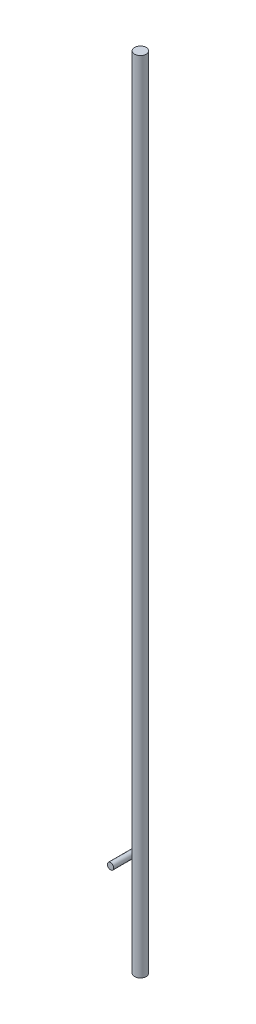
ISO-10303-21;
HEADER;
FILE_DESCRIPTION(('STEP AP214'),'2;1');
FILE_NAME('part.step','',(''),(''),'','','');
FILE_SCHEMA(('AUTOMOTIVE_DESIGN { 1 0 10303 214 1 1 1 1 }'));
ENDSEC;
DATA;
#1=APPLICATION_CONTEXT('core data for automotive mechanical design processes');
#2=APPLICATION_PROTOCOL_DEFINITION('international standard','automotive_design',2000,#1);
#3=PRODUCT_CONTEXT('',#1,'mechanical');
#4=PRODUCT('Part','Part','',(#3));
#5=PRODUCT_RELATED_PRODUCT_CATEGORY('part','',(#4));
#6=PRODUCT_DEFINITION_FORMATION('','',#4);
#7=PRODUCT_DEFINITION_CONTEXT('part definition',#1,'design');
#8=PRODUCT_DEFINITION('design','',#6,#7);
#9=PRODUCT_DEFINITION_SHAPE('','',#8);
#10=(LENGTH_UNIT() NAMED_UNIT(*) SI_UNIT(.MILLI.,.METRE.));
#11=(NAMED_UNIT(*) PLANE_ANGLE_UNIT() SI_UNIT($,.RADIAN.));
#12=(NAMED_UNIT(*) SI_UNIT($,.STERADIAN.) SOLID_ANGLE_UNIT());
#13=UNCERTAINTY_MEASURE_WITH_UNIT(LENGTH_MEASURE(1.E-05),#10,'distance_accuracy_value','');
#14=(GEOMETRIC_REPRESENTATION_CONTEXT(3) GLOBAL_UNCERTAINTY_ASSIGNED_CONTEXT((#13)) GLOBAL_UNIT_ASSIGNED_CONTEXT((#10,
#11,#12)) REPRESENTATION_CONTEXT('',''));
#15=CARTESIAN_POINT('',(0.,0.,0.));
#16=DIRECTION('',(0.,0.,1.));
#17=DIRECTION('',(1.,0.,0.));
#18=AXIS2_PLACEMENT_3D('',#15,#16,#17);
#19=CARTESIAN_POINT('',(0.,-9.,0.));
#20=DIRECTION('',(0.,1.,0.));
#21=DIRECTION('',(0.,0.,1.));
#22=AXIS2_PLACEMENT_3D('',#19,#20,#21);
#23=CYLINDRICAL_SURFACE('',#22,0.55);
#24=CARTESIAN_POINT('',(-0.5,0.3,-0.229128784747792));
#25=CARTESIAN_POINT('',(-0.500000615052009,0.292780073128567,-0.229127960567522));
#26=CARTESIAN_POINT('',(-0.500263617192523,0.285548124588731,-0.228556254733447));
#27=CARTESIAN_POINT('',(-0.501291039483298,0.271287392833323,-0.226293468677813));
#28=CARTESIAN_POINT('',(-0.502056758931474,0.264259185478576,-0.224599487776873));
#29=CARTESIAN_POINT('',(-0.504009916052999,0.250633785424472,-0.220181184157631));
#30=CARTESIAN_POINT('',(-0.505195462860505,0.244034814697188,-0.217461477703977));
#31=CARTESIAN_POINT('',(-0.507883351945307,0.231371757249211,-0.21110743743554));
#32=CARTESIAN_POINT('',(-0.509385588579757,0.225307493113013,-0.207473408546608));
#33=CARTESIAN_POINT('',(-0.512751891877452,0.213214115031851,-0.199017841941242));
#34=CARTESIAN_POINT('',(-0.514637095993687,0.207248692518458,-0.194114066562963));
#35=CARTESIAN_POINT('',(-0.51850683464525,0.196093745383431,-0.183528117036071));
#36=CARTESIAN_POINT('',(-0.52049144478887,0.190904823707308,-0.177845344496362));
#37=CARTESIAN_POINT('',(-0.525470949311629,0.178769368260982,-0.162702997579471));
#38=CARTESIAN_POINT('',(-0.528448729990879,0.172332019595852,-0.152827946500478));
#39=CARTESIAN_POINT('',(-0.534014906246082,0.161107184773262,-0.132077345613177));
#40=CARTESIAN_POINT('',(-0.536602380055928,0.156323570797794,-0.121199522200019));
#41=CARTESIAN_POINT('',(-0.541845828857075,0.147052443031229,-0.0955037784663739));
#42=CARTESIAN_POINT('',(-0.544299762020906,0.143062313613454,-0.0804652274536857));
#43=CARTESIAN_POINT('',(-0.547955804363976,0.13725723485879,-0.0498335801124002));
#44=CARTESIAN_POINT('',(-0.549156980690798,0.135443906302627,-0.0342400794683822));
#45=CARTESIAN_POINT('',(-0.550222437242496,0.133831082835456,-0.00270494681483289));
#46=CARTESIAN_POINT('',(-0.55006939295928,0.134057685345915,0.0132385858586871));
#47=CARTESIAN_POINT('',(-0.548393899350324,0.136608241015638,0.0448853839492023));
#48=CARTESIAN_POINT('',(-0.546872042166469,0.138931287264873,0.0605887502739115));
#49=CARTESIAN_POINT('',(-0.542914809312699,0.145342550478439,0.0889773282619028));
#50=CARTESIAN_POINT('',(-0.540652955672643,0.149109676618298,0.101759117020398));
#51=CARTESIAN_POINT('',(-0.535410485374579,0.158502769329982,0.126467685999101));
#52=CARTESIAN_POINT('',(-0.532430908808856,0.164126050371813,0.138395671359755));
#53=CARTESIAN_POINT('',(-0.526869600966437,0.175782216830233,0.158068054402563));
#54=CARTESIAN_POINT('',(-0.524376673506454,0.181355234290787,0.166109496634244));
#55=CARTESIAN_POINT('',(-0.519367360557462,0.193746342392372,0.181163295588935));
#56=CARTESIAN_POINT('',(-0.516851012765064,0.200562680282243,0.188177076252886));
#57=CARTESIAN_POINT('',(-0.512510052946658,0.214036672296523,0.199659616665285));
#58=CARTESIAN_POINT('',(-0.510644274194136,0.220483793210186,0.204358966043845));
#59=CARTESIAN_POINT('',(-0.507237458937944,0.23412596130427,0.212674338803907));
#60=CARTESIAN_POINT('',(-0.5056962995694,0.241320723965192,0.216290772276502));
#61=CARTESIAN_POINT('',(-0.503093031542915,0.256356520917574,0.222279732754516));
#62=CARTESIAN_POINT('',(-0.5020342663879,0.264201633280307,0.224643595969569));
#63=CARTESIAN_POINT('',(-0.500543162928967,0.280244138025832,0.227947279204893));
#64=CARTESIAN_POINT('',(-0.500110441357369,0.288441311706452,0.228887970515775));
#65=CARTESIAN_POINT('',(-0.499937570418446,0.30391001414519,0.229264842627182));
#66=CARTESIAN_POINT('',(-0.500122081698287,0.311177241591148,0.228864677807365));
#67=CARTESIAN_POINT('',(-0.50100158347444,0.325526104240811,0.226932872983028));
#68=CARTESIAN_POINT('',(-0.501696490345602,0.332607769650871,0.225401418333095));
#69=CARTESIAN_POINT('',(-0.503509718512839,0.346261489224009,0.221320511711263));
#70=CARTESIAN_POINT('',(-0.50461975601312,0.352840663130478,0.218790925977986));
#71=CARTESIAN_POINT('',(-0.507166511336889,0.365500389622152,0.212820646263089));
#72=CARTESIAN_POINT('',(-0.508603298642891,0.371580835779435,0.20937975846976));
#73=CARTESIAN_POINT('',(-0.511849854191815,0.383744076090674,0.201321491849194));
#74=CARTESIAN_POINT('',(-0.513682648018052,0.389764914692259,0.196620322812821));
#75=CARTESIAN_POINT('',(-0.51746834067469,0.401051233501053,0.186430116018835));
#76=CARTESIAN_POINT('',(-0.519421318698439,0.406316207862836,0.180940555517194));
#77=CARTESIAN_POINT('',(-0.524322386527122,0.418597958166595,0.166346761067998));
#78=CARTESIAN_POINT('',(-0.527267555077224,0.425129819971954,0.15683178273265));
#79=CARTESIAN_POINT('',(-0.532821163342139,0.436587218746643,0.136786868879401));
#80=CARTESIAN_POINT('',(-0.535428806126087,0.441508994502317,0.12625463024028));
#81=CARTESIAN_POINT('',(-0.540794391340185,0.451168575934791,0.101241410136865));
#82=CARTESIAN_POINT('',(-0.54336134743728,0.455405152032708,0.0865260403898665));
#83=CARTESIAN_POINT('',(-0.547301347493032,0.461731270371875,0.0564945438084415));
#84=CARTESIAN_POINT('',(-0.548673488461788,0.463819188966462,0.0411779717311298));
#85=CARTESIAN_POINT('',(-0.550129516613197,0.466031644378769,0.0101250847259749));
#86=CARTESIAN_POINT('',(-0.550194739741033,0.466127736649009,-0.00561410095782929));
#87=CARTESIAN_POINT('',(-0.548982503555806,0.464291039433624,-0.0369228006015882));
#88=CARTESIAN_POINT('',(-0.547705406343319,0.462358797106039,-0.0524923591752315));
#89=CARTESIAN_POINT('',(-0.544133274198306,0.456658898127433,-0.0812665168632025));
#90=CARTESIAN_POINT('',(-0.541974146577982,0.453131265164646,-0.0945353347038504));
#91=CARTESIAN_POINT('',(-0.536853185146215,0.444154875600608,-0.120247325369138));
#92=CARTESIAN_POINT('',(-0.533892437454966,0.438708715439619,-0.13269158719789));
#93=CARTESIAN_POINT('',(-0.528303302302386,0.427318084754432,-0.153227275393883));
#94=CARTESIAN_POINT('',(-0.525784104394764,0.421858762646939,-0.161617073907401));
#95=CARTESIAN_POINT('',(-0.520678277072094,0.409649564271953,-0.17737626727889));
#96=CARTESIAN_POINT('',(-0.518091761580121,0.402901759649638,-0.184747267822253));
#97=CARTESIAN_POINT('',(-0.513603422063562,0.389535133263326,-0.196837357100697));
#98=CARTESIAN_POINT('',(-0.51166590740201,0.383143630850994,-0.201793634118933));
#99=CARTESIAN_POINT('',(-0.508092840356811,0.369565534326612,-0.210628596653856));
#100=CARTESIAN_POINT('',(-0.506457374127147,0.362378714296158,-0.214506974877697));
#101=CARTESIAN_POINT('',(-0.503651732228966,0.347296885193054,-0.221015236340717));
#102=CARTESIAN_POINT('',(-0.502485588915381,0.3393964242852,-0.223634335861985));
#103=CARTESIAN_POINT('',(-0.500788890127222,0.32320274668569,-0.227409252110794));
#104=CARTESIAN_POINT('',(-0.500256116708228,0.314911006900157,-0.228570175913194));
#105=CARTESIAN_POINT('',(-0.500023966911561,0.304396993161306,-0.2290763262732));
#106=CARTESIAN_POINT('',(-0.499999812666703,0.302199054204091,-0.229129035777632));
#107=CARTESIAN_POINT('',(-0.5,0.3,-0.229128784747792));
#108=B_SPLINE_CURVE_WITH_KNOTS('',3,(#24,#25,#26,#27,#28,#29,#30,#31,#32,#33,#34,#35,#36,#37,
#38,#39,#40,#41,#42,#43,#44,#45,#46,#47,#48,#49,#50,#51,#52,#53,#54,#55,#56,#57,#58,#59,#60,#61,
#62,#63,#64,#65,#66,#67,#68,#69,#70,#71,#72,#73,#74,#75,#76,#77,#78,#79,#80,#81,#82,#83,#84,#85,
#86,#87,#88,#89,#90,#91,#92,#93,#94,#95,#96,#97,#98,#99,#100,#101,#102,#103,#104,#105,#106,
#107),.UNSPECIFIED.,.T.,.F.,(4,2,2,2,2,2,2,2,2,2,2,2,2,2,2,2,2,2,2,2,2,2,2,2,2,2,2,2,2,2,2,2,2,
2,2,2,2,2,2,2,2,4),(0.,0.0216540065189272,0.0433642003886249,0.0649778316909561,
0.0865842643957392,0.110343253934834,0.134120597429102,0.170392215922303,0.206748197319461,
0.253755994950514,0.300798771513836,0.348444226605623,0.396069080410436,0.43647205105778,
0.476816820071673,0.507000345265475,0.537141644036394,0.561623289403841,0.586095652020478,
0.610735145859877,0.63535954885933,0.657093235549981,0.678823362104999,0.700141193064925,
0.721463561453055,0.7449423755788,0.768436829859763,0.803971122005495,0.839587840311551,
0.885924475273332,0.932296099153078,0.979329490130709,1.02635019676801,1.06789354564355,
1.10938088643471,1.14023912201728,1.17104815469475,1.19590030117396,1.22075952537835,
1.24582799664503,1.2708084217145,1.27740382564571),.UNSPECIFIED.);
#109=CARTESIAN_POINT('',(-0.5,0.3,-0.229128784747792));
#110=VERTEX_POINT('',#109);
#111=EDGE_CURVE('E10',#110,#110,#108,.T.);
#112=ORIENTED_EDGE('',*,*,#111,.F.);
#113=EDGE_LOOP('',(#112));
#114=FACE_BOUND('',#113,.T.);
#115=CARTESIAN_POINT('',(0.,-9.,0.));
#116=DIRECTION('',(0.,1.,0.));
#117=DIRECTION('',(0.,0.,1.));
#118=AXIS2_PLACEMENT_3D('',#115,#116,#117);
#119=CIRCLE('',#118,0.55);
#120=CARTESIAN_POINT('',(0.,-9.,0.55));
#121=VERTEX_POINT('',#120);
#122=EDGE_CURVE('E40',#121,#121,#119,.T.);
#123=ORIENTED_EDGE('',*,*,#122,.T.);
#124=EDGE_LOOP('',(#123));
#125=FACE_BOUND('',#124,.T.);
#126=CARTESIAN_POINT('',(0.,66.,0.));
#127=DIRECTION('',(0.,1.,0.));
#128=DIRECTION('',(0.,0.,1.));
#129=AXIS2_PLACEMENT_3D('',#126,#127,#128);
#130=CIRCLE('',#129,0.55);
#131=CARTESIAN_POINT('',(0.,66.,0.55));
#132=VERTEX_POINT('',#131);
#133=EDGE_CURVE('E44',#132,#132,#130,.T.);
#134=ORIENTED_EDGE('',*,*,#133,.F.);
#135=EDGE_LOOP('',(#134));
#136=FACE_BOUND('',#135,.T.);
#137=ADVANCED_FACE('F30',(#114,#125,#136),#23,.T.);
#138=CARTESIAN_POINT('',(0.,-9.,0.));
#139=DIRECTION('',(0.,1.,0.));
#140=DIRECTION('',(0.,0.,1.));
#141=AXIS2_PLACEMENT_3D('',#138,#139,#140);
#142=PLANE('',#141);
#143=ORIENTED_EDGE('',*,*,#122,.F.);
#144=EDGE_LOOP('',(#143));
#145=FACE_BOUND('',#144,.T.);
#146=ADVANCED_FACE('F69',(#145),#142,.F.);
#147=CARTESIAN_POINT('',(0.,66.,0.));
#148=DIRECTION('',(0.,1.,0.));
#149=DIRECTION('',(0.,0.,1.));
#150=AXIS2_PLACEMENT_3D('',#147,#148,#149);
#151=PLANE('',#150);
#152=ORIENTED_EDGE('',*,*,#133,.T.);
#153=EDGE_LOOP('',(#152));
#154=FACE_BOUND('',#153,.T.);
#155=ADVANCED_FACE('F62',(#154),#151,.T.);
#156=CARTESIAN_POINT('',(-0.8,0.3,-0.5));
#157=DIRECTION('',(0.,0.,1.));
#158=DIRECTION('',(1.,0.,0.));
#159=AXIS2_PLACEMENT_3D('',#156,#157,#158);
#160=CYLINDRICAL_SURFACE('',#159,0.3);
#161=ORIENTED_EDGE('',*,*,#111,.T.);
#162=EDGE_LOOP('',(#161));
#163=FACE_BOUND('',#162,.T.);
#164=CARTESIAN_POINT('',(-0.8,0.3,-0.5));
#165=DIRECTION('',(0.,0.,1.));
#166=DIRECTION('',(1.,0.,0.));
#167=AXIS2_PLACEMENT_3D('',#164,#165,#166);
#168=CIRCLE('',#167,0.3);
#169=CARTESIAN_POINT('',(-0.5,0.3,-0.5));
#170=VERTEX_POINT('',#169);
#171=EDGE_CURVE('E48',#170,#170,#168,.T.);
#172=ORIENTED_EDGE('',*,*,#171,.T.);
#173=EDGE_LOOP('',(#172));
#174=FACE_BOUND('',#173,.T.);
#175=CARTESIAN_POINT('',(-0.8,0.3,2.));
#176=DIRECTION('',(0.,0.,1.));
#177=DIRECTION('',(1.,0.,0.));
#178=AXIS2_PLACEMENT_3D('',#175,#176,#177);
#179=CIRCLE('',#178,0.3);
#180=CARTESIAN_POINT('',(-0.5,0.3,2.));
#181=VERTEX_POINT('',#180);
#182=EDGE_CURVE('E53',#181,#181,#179,.T.);
#183=ORIENTED_EDGE('',*,*,#182,.F.);
#184=EDGE_LOOP('',(#183));
#185=FACE_BOUND('',#184,.T.);
#186=ADVANCED_FACE('F59',(#163,#174,#185),#160,.T.);
#187=CARTESIAN_POINT('',(-0.8,0.3,-0.5));
#188=DIRECTION('',(0.,0.,1.));
#189=DIRECTION('',(1.,0.,0.));
#190=AXIS2_PLACEMENT_3D('',#187,#188,#189);
#191=PLANE('',#190);
#192=ORIENTED_EDGE('',*,*,#171,.F.);
#193=EDGE_LOOP('',(#192));
#194=FACE_BOUND('',#193,.T.);
#195=ADVANCED_FACE('F61',(#194),#191,.F.);
#196=CARTESIAN_POINT('',(-0.8,0.3,2.));
#197=DIRECTION('',(0.,0.,1.));
#198=DIRECTION('',(1.,0.,0.));
#199=AXIS2_PLACEMENT_3D('',#196,#197,#198);
#200=PLANE('',#199);
#201=ORIENTED_EDGE('',*,*,#182,.T.);
#202=EDGE_LOOP('',(#201));
#203=FACE_BOUND('',#202,.T.);
#204=ADVANCED_FACE('F57',(#203),#200,.T.);
#205=CLOSED_SHELL('',(#137,#146,#155,#186,#195,#204));
#206=MANIFOLD_SOLID_BREP('B2',#205);
#207=ADVANCED_BREP_SHAPE_REPRESENTATION('',(#18,#206),#14);
#208=SHAPE_DEFINITION_REPRESENTATION(#9,#207);
ENDSEC;
END-ISO-10303-21;
